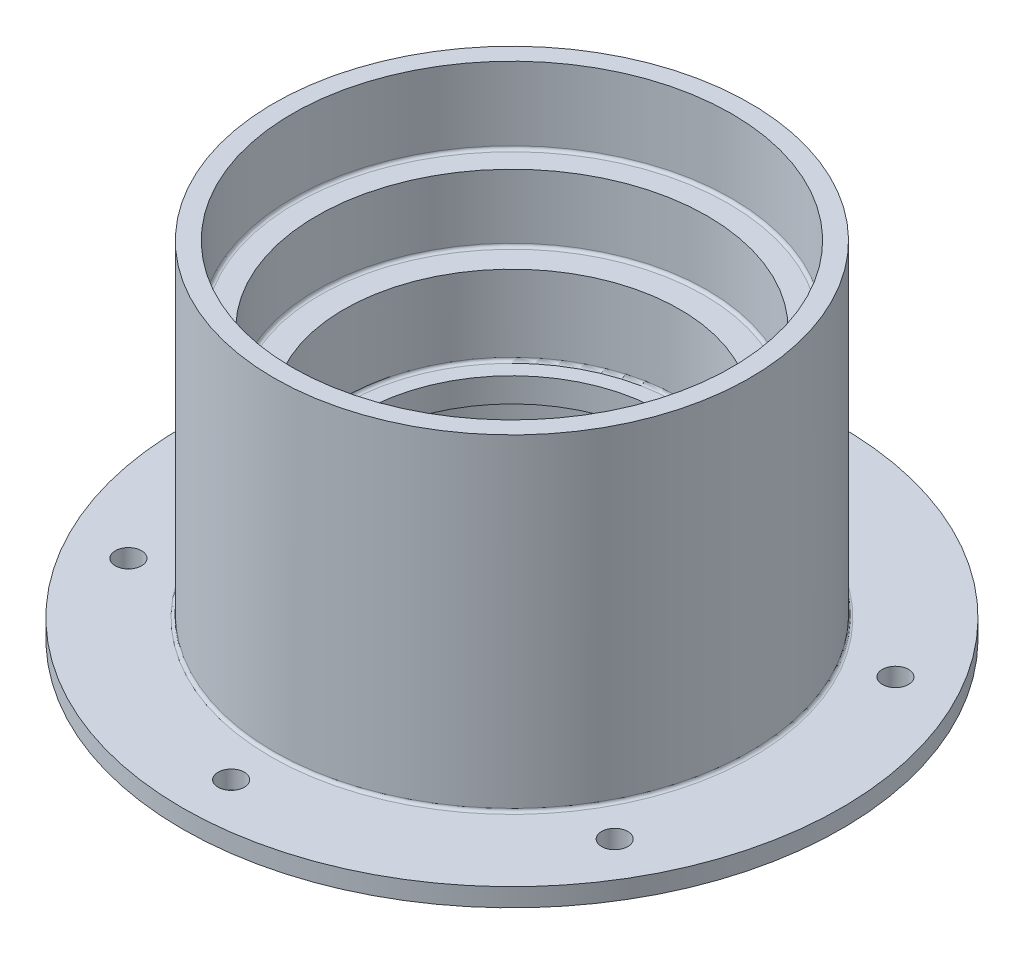
ISO-10303-21;
HEADER;
FILE_DESCRIPTION(('STEP AP214'),'2;1');
FILE_NAME('part.step','',(''),(''),'','','');
FILE_SCHEMA(('AUTOMOTIVE_DESIGN { 1 0 10303 214 1 1 1 1 }'));
ENDSEC;
DATA;
#1=APPLICATION_CONTEXT('core data for automotive mechanical design processes');
#2=APPLICATION_PROTOCOL_DEFINITION('international standard','automotive_design',2000,#1);
#3=PRODUCT_CONTEXT('',#1,'mechanical');
#4=PRODUCT('Part','Part','',(#3));
#5=PRODUCT_RELATED_PRODUCT_CATEGORY('part','',(#4));
#6=PRODUCT_DEFINITION_FORMATION('','',#4);
#7=PRODUCT_DEFINITION_CONTEXT('part definition',#1,'design');
#8=PRODUCT_DEFINITION('design','',#6,#7);
#9=PRODUCT_DEFINITION_SHAPE('','',#8);
#10=(LENGTH_UNIT() NAMED_UNIT(*) SI_UNIT(.MILLI.,.METRE.));
#11=(NAMED_UNIT(*) PLANE_ANGLE_UNIT() SI_UNIT($,.RADIAN.));
#12=(NAMED_UNIT(*) SI_UNIT($,.STERADIAN.) SOLID_ANGLE_UNIT());
#13=UNCERTAINTY_MEASURE_WITH_UNIT(LENGTH_MEASURE(1.E-05),#10,'distance_accuracy_value','');
#14=(GEOMETRIC_REPRESENTATION_CONTEXT(3) GLOBAL_UNCERTAINTY_ASSIGNED_CONTEXT((#13)) GLOBAL_UNIT_ASSIGNED_CONTEXT((#10,
#11,#12)) REPRESENTATION_CONTEXT('',''));
#15=CARTESIAN_POINT('',(0.,0.,0.));
#16=DIRECTION('',(0.,0.,1.));
#17=DIRECTION('',(1.,0.,0.));
#18=AXIS2_PLACEMENT_3D('',#15,#16,#17);
#19=CARTESIAN_POINT('',(0.,-3.,0.));
#20=DIRECTION('',(0.,1.,0.));
#21=DIRECTION('',(0.,0.,1.));
#22=AXIS2_PLACEMENT_3D('',#19,#20,#21);
#23=PLANE('',#22);
#24=CARTESIAN_POINT('',(0.,-3.,0.));
#25=DIRECTION('',(0.,1.,0.));
#26=DIRECTION('',(0.,0.,1.));
#27=AXIS2_PLACEMENT_3D('',#24,#25,#26);
#28=CIRCLE('',#27,39.);
#29=CARTESIAN_POINT('',(0.,-3.,39.));
#30=VERTEX_POINT('',#29);
#31=EDGE_CURVE('E166',#30,#30,#28,.T.);
#32=ORIENTED_EDGE('',*,*,#31,.T.);
#33=EDGE_LOOP('',(#32));
#34=FACE_BOUND('',#33,.T.);
#35=CARTESIAN_POINT('',(0.,-3.,0.));
#36=DIRECTION('',(0.,1.,0.));
#37=DIRECTION('',(0.,0.,1.));
#38=AXIS2_PLACEMENT_3D('',#35,#36,#37);
#39=CIRCLE('',#38,36.);
#40=CARTESIAN_POINT('',(0.,-3.,36.));
#41=VERTEX_POINT('',#40);
#42=EDGE_CURVE('E142',#41,#41,#39,.T.);
#43=ORIENTED_EDGE('',*,*,#42,.F.);
#44=EDGE_LOOP('',(#43));
#45=FACE_BOUND('',#44,.T.);
#46=ADVANCED_FACE('F38',(#34,#45),#23,.T.);
#47=CARTESIAN_POINT('',(0.,0.,0.));
#48=DIRECTION('',(0.,1.,0.));
#49=DIRECTION('',(0.,0.,1.));
#50=AXIS2_PLACEMENT_3D('',#47,#48,#49);
#51=CYLINDRICAL_SURFACE('',#50,39.);
#52=DIRECTION('',(0.,-1.,0.));
#53=VECTOR('',#52,1.);
#54=CARTESIAN_POINT('',(-37.4165738677394,-46.5,11.));
#55=LINE('',#54,#53);
#56=CARTESIAN_POINT('',(-37.4165738677394,-46.5,11.));
#57=VERTEX_POINT('',#56);
#58=CARTESIAN_POINT('',(-37.4165738677394,-56.,11.));
#59=VERTEX_POINT('',#58);
#60=EDGE_CURVE('E107',#57,#59,#55,.T.);
#61=ORIENTED_EDGE('',*,*,#60,.T.);
#62=CARTESIAN_POINT('',(0.,-56.,0.));
#63=DIRECTION('',(0.,-1.,0.));
#64=DIRECTION('',(0.,0.,-1.));
#65=AXIS2_PLACEMENT_3D('',#62,#63,#64);
#66=CIRCLE('',#65,39.);
#67=CARTESIAN_POINT('',(-37.4165738677394,-56.,-11.));
#68=VERTEX_POINT('',#67);
#69=EDGE_CURVE('E113',#59,#68,#66,.F.);
#70=ORIENTED_EDGE('',*,*,#69,.T.);
#71=DIRECTION('',(0.,-1.,0.));
#72=VECTOR('',#71,1.);
#73=CARTESIAN_POINT('',(-37.4165738677394,-46.5,-11.));
#74=LINE('',#73,#72);
#75=CARTESIAN_POINT('',(-37.4165738677394,-46.5,-11.));
#76=VERTEX_POINT('',#75);
#77=EDGE_CURVE('E93',#76,#68,#74,.T.);
#78=ORIENTED_EDGE('',*,*,#77,.F.);
#79=CARTESIAN_POINT('',(0.,-46.5,0.));
#80=DIRECTION('',(0.,1.,0.));
#81=DIRECTION('',(0.,0.,1.));
#82=AXIS2_PLACEMENT_3D('',#79,#80,#81);
#83=CIRCLE('',#82,39.);
#84=EDGE_CURVE('E98',#57,#76,#83,.F.);
#85=ORIENTED_EDGE('',*,*,#84,.F.);
#86=EDGE_LOOP('',(#61,#70,#78,#85));
#87=FACE_BOUND('',#86,.T.);
#88=ORIENTED_EDGE('',*,*,#31,.F.);
#89=EDGE_LOOP('',(#88));
#90=FACE_BOUND('',#89,.T.);
#91=ADVANCED_FACE('F110',(#87,#90),#51,.T.);
#92=CARTESIAN_POINT('',(0.,-56.5,0.));
#93=DIRECTION('',(0.,-1.,0.));
#94=DIRECTION('',(0.,0.,-1.));
#95=AXIS2_PLACEMENT_3D('',#92,#93,#94);
#96=PLANE('',#95);
#97=CARTESIAN_POINT('',(0.,-56.5,-46.));
#98=DIRECTION('',(0.,1.,0.));
#99=DIRECTION('',(0.,0.,1.));
#100=AXIS2_PLACEMENT_3D('',#97,#98,#99);
#101=CIRCLE('',#100,2.14999999999999);
#102=CARTESIAN_POINT('',(0.,-56.5,-43.85));
#103=VERTEX_POINT('',#102);
#104=EDGE_CURVE('E114',#103,#103,#101,.T.);
#105=ORIENTED_EDGE('',*,*,#104,.F.);
#106=EDGE_LOOP('',(#105));
#107=FACE_BOUND('',#106,.T.);
#108=CARTESIAN_POINT('',(39.837168574085,-56.5,-23.0000000000014));
#109=DIRECTION('',(0.,1.,0.));
#110=DIRECTION('',(0.,0.,1.));
#111=AXIS2_PLACEMENT_3D('',#108,#109,#110);
#112=CIRCLE('',#111,2.14999999999999);
#113=CARTESIAN_POINT('',(39.837168574085,-56.5,-20.8500000000014));
#114=VERTEX_POINT('',#113);
#115=EDGE_CURVE('E122',#114,#114,#112,.T.);
#116=ORIENTED_EDGE('',*,*,#115,.F.);
#117=EDGE_LOOP('',(#116));
#118=FACE_BOUND('',#117,.T.);
#119=CARTESIAN_POINT('',(39.8371685740866,-56.5,22.9999999999986));
#120=DIRECTION('',(0.,1.,0.));
#121=DIRECTION('',(0.,0.,1.));
#122=AXIS2_PLACEMENT_3D('',#119,#120,#121);
#123=CIRCLE('',#122,2.14999999999999);
#124=CARTESIAN_POINT('',(39.8371685740866,-56.5,25.1499999999986));
#125=VERTEX_POINT('',#124);
#126=EDGE_CURVE('E126',#125,#125,#123,.T.);
#127=ORIENTED_EDGE('',*,*,#126,.F.);
#128=EDGE_LOOP('',(#127));
#129=FACE_BOUND('',#128,.T.);
#130=CARTESIAN_POINT('',(3.27419614395759E-12,-56.5,46.));
#131=DIRECTION('',(0.,1.,0.));
#132=DIRECTION('',(0.,0.,1.));
#133=AXIS2_PLACEMENT_3D('',#130,#131,#132);
#134=CIRCLE('',#133,2.14999999999999);
#135=CARTESIAN_POINT('',(3.27419614395759E-12,-56.5,48.15));
#136=VERTEX_POINT('',#135);
#137=EDGE_CURVE('E130',#136,#136,#134,.T.);
#138=ORIENTED_EDGE('',*,*,#137,.F.);
#139=EDGE_LOOP('',(#138));
#140=FACE_BOUND('',#139,.T.);
#141=CARTESIAN_POINT('',(-39.8371685740817,-56.5,23.0000000000014));
#142=DIRECTION('',(0.,1.,0.));
#143=DIRECTION('',(0.,0.,1.));
#144=AXIS2_PLACEMENT_3D('',#141,#142,#143);
#145=CIRCLE('',#144,2.14999999999999);
#146=CARTESIAN_POINT('',(-39.8371685740817,-56.5,25.1500000000014));
#147=VERTEX_POINT('',#146);
#148=EDGE_CURVE('E134',#147,#147,#145,.T.);
#149=ORIENTED_EDGE('',*,*,#148,.F.);
#150=EDGE_LOOP('',(#149));
#151=FACE_BOUND('',#150,.T.);
#152=CARTESIAN_POINT('',(-39.8371685740834,-56.5,-22.9999999999986));
#153=DIRECTION('',(0.,1.,0.));
#154=DIRECTION('',(0.,0.,1.));
#155=AXIS2_PLACEMENT_3D('',#152,#153,#154);
#156=CIRCLE('',#155,2.14999999999999);
#157=CARTESIAN_POINT('',(-39.8371685740834,-56.5,-20.8499999999986));
#158=VERTEX_POINT('',#157);
#159=EDGE_CURVE('E138',#158,#158,#156,.T.);
#160=ORIENTED_EDGE('',*,*,#159,.F.);
#161=EDGE_LOOP('',(#160));
#162=FACE_BOUND('',#161,.T.);
#163=DIRECTION('',(-1.,0.,0.));
#164=VECTOR('',#163,1.);
#165=CARTESIAN_POINT('',(0.,-56.5,-11.));
#166=LINE('',#165,#164);
#167=CARTESIAN_POINT('',(-30.0499584026334,-56.5,-11.));
#168=VERTEX_POINT('',#167);
#169=CARTESIAN_POINT('',(-37.9374485172632,-56.5,-11.));
#170=VERTEX_POINT('',#169);
#171=EDGE_CURVE('E58',#168,#170,#166,.T.);
#172=ORIENTED_EDGE('',*,*,#171,.T.);
#173=CARTESIAN_POINT('',(0.,-56.5,0.));
#174=DIRECTION('',(0.,-1.,0.));
#175=DIRECTION('',(0.,0.,-1.));
#176=AXIS2_PLACEMENT_3D('',#173,#174,#175);
#177=CIRCLE('',#176,39.5);
#178=CARTESIAN_POINT('',(-37.9374485172632,-56.5,11.));
#179=VERTEX_POINT('',#178);
#180=EDGE_CURVE('E202',#170,#179,#177,.T.);
#181=ORIENTED_EDGE('',*,*,#180,.T.);
#182=DIRECTION('',(-1.,0.,0.));
#183=VECTOR('',#182,1.);
#184=CARTESIAN_POINT('',(0.,-56.5,11.));
#185=LINE('',#184,#183);
#186=CARTESIAN_POINT('',(-30.0499584026334,-56.5,11.));
#187=VERTEX_POINT('',#186);
#188=EDGE_CURVE('E65',#187,#179,#185,.T.);
#189=ORIENTED_EDGE('',*,*,#188,.F.);
#190=CARTESIAN_POINT('',(0.,-56.5,0.));
#191=DIRECTION('',(0.,1.,0.));
#192=DIRECTION('',(0.,0.,1.));
#193=AXIS2_PLACEMENT_3D('',#190,#191,#192);
#194=CIRCLE('',#193,32.);
#195=EDGE_CURVE('E169',#187,#168,#194,.F.);
#196=ORIENTED_EDGE('',*,*,#195,.T.);
#197=EDGE_LOOP('',(#172,#181,#189,#196));
#198=FACE_BOUND('',#197,.T.);
#199=CARTESIAN_POINT('',(0.,-56.5,0.));
#200=DIRECTION('',(0.,1.,0.));
#201=DIRECTION('',(0.,0.,1.));
#202=AXIS2_PLACEMENT_3D('',#199,#200,#201);
#203=CIRCLE('',#202,54.);
#204=CARTESIAN_POINT('',(0.,-56.5,54.));
#205=VERTEX_POINT('',#204);
#206=EDGE_CURVE('E163',#205,#205,#203,.T.);
#207=ORIENTED_EDGE('',*,*,#206,.T.);
#208=EDGE_LOOP('',(#207));
#209=FACE_BOUND('',#208,.T.);
#210=ADVANCED_FACE('F296',(#107,#118,#129,#140,#151,#162,#198,#209),#96,.F.);
#211=CARTESIAN_POINT('',(0.,0.,0.));
#212=DIRECTION('',(0.,1.,0.));
#213=DIRECTION('',(0.,0.,1.));
#214=AXIS2_PLACEMENT_3D('',#211,#212,#213);
#215=CYLINDRICAL_SURFACE('',#214,54.);
#216=ORIENTED_EDGE('',*,*,#206,.F.);
#217=EDGE_LOOP('',(#216));
#218=FACE_BOUND('',#217,.T.);
#219=CARTESIAN_POINT('',(0.,-59.5,0.));
#220=DIRECTION('',(0.,1.,0.));
#221=DIRECTION('',(0.,0.,1.));
#222=AXIS2_PLACEMENT_3D('',#219,#220,#221);
#223=CIRCLE('',#222,54.);
#224=CARTESIAN_POINT('',(0.,-59.5,54.));
#225=VERTEX_POINT('',#224);
#226=EDGE_CURVE('E160',#225,#225,#223,.T.);
#227=ORIENTED_EDGE('',*,*,#226,.T.);
#228=EDGE_LOOP('',(#227));
#229=FACE_BOUND('',#228,.T.);
#230=ADVANCED_FACE('F292',(#218,#229),#215,.T.);
#231=CARTESIAN_POINT('',(0.,-59.5,0.));
#232=DIRECTION('',(0.,1.,0.));
#233=DIRECTION('',(0.,0.,1.));
#234=AXIS2_PLACEMENT_3D('',#231,#232,#233);
#235=PLANE('',#234);
#236=CARTESIAN_POINT('',(0.,-59.5,-46.));
#237=DIRECTION('',(0.,1.,0.));
#238=DIRECTION('',(0.,0.,1.));
#239=AXIS2_PLACEMENT_3D('',#236,#237,#238);
#240=CIRCLE('',#239,2.14999999999998);
#241=CARTESIAN_POINT('',(0.,-59.5,-43.85));
#242=VERTEX_POINT('',#241);
#243=EDGE_CURVE('E117',#242,#242,#240,.T.);
#244=ORIENTED_EDGE('',*,*,#243,.T.);
#245=EDGE_LOOP('',(#244));
#246=FACE_BOUND('',#245,.T.);
#247=CARTESIAN_POINT('',(39.837168574085,-59.5,-23.0000000000014));
#248=DIRECTION('',(0.,1.,0.));
#249=DIRECTION('',(0.,0.,1.));
#250=AXIS2_PLACEMENT_3D('',#247,#248,#249);
#251=CIRCLE('',#250,2.14999999999998);
#252=CARTESIAN_POINT('',(39.837168574085,-59.5,-20.8500000000014));
#253=VERTEX_POINT('',#252);
#254=EDGE_CURVE('E125',#253,#253,#251,.T.);
#255=ORIENTED_EDGE('',*,*,#254,.T.);
#256=EDGE_LOOP('',(#255));
#257=FACE_BOUND('',#256,.T.);
#258=CARTESIAN_POINT('',(39.8371685740866,-59.5,22.9999999999986));
#259=DIRECTION('',(0.,1.,0.));
#260=DIRECTION('',(0.,0.,1.));
#261=AXIS2_PLACEMENT_3D('',#258,#259,#260);
#262=CIRCLE('',#261,2.14999999999998);
#263=CARTESIAN_POINT('',(39.8371685740866,-59.5,25.1499999999986));
#264=VERTEX_POINT('',#263);
#265=EDGE_CURVE('E129',#264,#264,#262,.T.);
#266=ORIENTED_EDGE('',*,*,#265,.T.);
#267=EDGE_LOOP('',(#266));
#268=FACE_BOUND('',#267,.T.);
#269=CARTESIAN_POINT('',(3.27419614395759E-12,-59.5,46.));
#270=DIRECTION('',(0.,1.,0.));
#271=DIRECTION('',(0.,0.,1.));
#272=AXIS2_PLACEMENT_3D('',#269,#270,#271);
#273=CIRCLE('',#272,2.14999999999998);
#274=CARTESIAN_POINT('',(3.27419614395759E-12,-59.5,48.15));
#275=VERTEX_POINT('',#274);
#276=EDGE_CURVE('E133',#275,#275,#273,.T.);
#277=ORIENTED_EDGE('',*,*,#276,.T.);
#278=EDGE_LOOP('',(#277));
#279=FACE_BOUND('',#278,.T.);
#280=CARTESIAN_POINT('',(-39.8371685740817,-59.5,23.0000000000014));
#281=DIRECTION('',(0.,1.,0.));
#282=DIRECTION('',(0.,0.,1.));
#283=AXIS2_PLACEMENT_3D('',#280,#281,#282);
#284=CIRCLE('',#283,2.14999999999998);
#285=CARTESIAN_POINT('',(-39.8371685740817,-59.5,25.1500000000014));
#286=VERTEX_POINT('',#285);
#287=EDGE_CURVE('E137',#286,#286,#284,.T.);
#288=ORIENTED_EDGE('',*,*,#287,.T.);
#289=EDGE_LOOP('',(#288));
#290=FACE_BOUND('',#289,.T.);
#291=CARTESIAN_POINT('',(-39.8371685740834,-59.5,-22.9999999999986));
#292=DIRECTION('',(0.,1.,0.));
#293=DIRECTION('',(0.,0.,1.));
#294=AXIS2_PLACEMENT_3D('',#291,#292,#293);
#295=CIRCLE('',#294,2.14999999999998);
#296=CARTESIAN_POINT('',(-39.8371685740834,-59.5,-20.8499999999986));
#297=VERTEX_POINT('',#296);
#298=EDGE_CURVE('E141',#297,#297,#295,.T.);
#299=ORIENTED_EDGE('',*,*,#298,.T.);
#300=EDGE_LOOP('',(#299));
#301=FACE_BOUND('',#300,.T.);
#302=ORIENTED_EDGE('',*,*,#226,.F.);
#303=EDGE_LOOP('',(#302));
#304=FACE_BOUND('',#303,.T.);
#305=CARTESIAN_POINT('',(0.,-59.5,0.));
#306=DIRECTION('',(0.,1.,0.));
#307=DIRECTION('',(0.,0.,1.));
#308=AXIS2_PLACEMENT_3D('',#305,#306,#307);
#309=CIRCLE('',#308,32.);
#310=CARTESIAN_POINT('',(0.,-59.5,32.));
#311=VERTEX_POINT('',#310);
#312=EDGE_CURVE('E157',#311,#311,#309,.T.);
#313=ORIENTED_EDGE('',*,*,#312,.T.);
#314=EDGE_LOOP('',(#313));
#315=FACE_BOUND('',#314,.T.);
#316=ADVANCED_FACE('F288',(#246,#257,#268,#279,#290,#301,#304,#315),#235,.F.);
#317=CARTESIAN_POINT('',(0.,0.,0.));
#318=DIRECTION('',(0.,1.,0.));
#319=DIRECTION('',(0.,0.,1.));
#320=AXIS2_PLACEMENT_3D('',#317,#318,#319);
#321=CYLINDRICAL_SURFACE('',#320,32.);
#322=CARTESIAN_POINT('',(0.,-44.,0.));
#323=DIRECTION('',(0.,1.,0.));
#324=DIRECTION('',(0.,0.,1.));
#325=AXIS2_PLACEMENT_3D('',#322,#323,#324);
#326=CIRCLE('',#325,32.);
#327=CARTESIAN_POINT('',(0.,-44.,32.));
#328=VERTEX_POINT('',#327);
#329=EDGE_CURVE('E189',#328,#328,#326,.T.);
#330=ORIENTED_EDGE('',*,*,#329,.T.);
#331=EDGE_LOOP('',(#330));
#332=FACE_BOUND('',#331,.T.);
#333=DIRECTION('',(0.,1.,0.));
#334=VECTOR('',#333,1.);
#335=CARTESIAN_POINT('',(-30.0499584026334,0.,11.));
#336=LINE('',#335,#334);
#337=CARTESIAN_POINT('',(-30.0499584026334,-46.5,11.));
#338=VERTEX_POINT('',#337);
#339=EDGE_CURVE('E184',#187,#338,#336,.T.);
#340=ORIENTED_EDGE('',*,*,#339,.T.);
#341=CARTESIAN_POINT('',(0.,-46.5,0.));
#342=DIRECTION('',(0.,1.,0.));
#343=DIRECTION('',(0.,0.,1.));
#344=AXIS2_PLACEMENT_3D('',#341,#342,#343);
#345=CIRCLE('',#344,32.);
#346=CARTESIAN_POINT('',(-30.0499584026334,-46.5,-11.));
#347=VERTEX_POINT('',#346);
#348=EDGE_CURVE('E187',#338,#347,#345,.F.);
#349=ORIENTED_EDGE('',*,*,#348,.T.);
#350=DIRECTION('',(0.,1.,0.));
#351=VECTOR('',#350,1.);
#352=CARTESIAN_POINT('',(-30.0499584026334,0.,-11.));
#353=LINE('',#352,#351);
#354=EDGE_CURVE('E95',#168,#347,#353,.T.);
#355=ORIENTED_EDGE('',*,*,#354,.F.);
#356=ORIENTED_EDGE('',*,*,#195,.F.);
#357=EDGE_LOOP('',(#340,#349,#355,#356));
#358=FACE_BOUND('',#357,.T.);
#359=ORIENTED_EDGE('',*,*,#312,.F.);
#360=EDGE_LOOP('',(#359));
#361=FACE_BOUND('',#360,.T.);
#362=ADVANCED_FACE('F284',(#332,#358,#361),#321,.F.);
#363=CARTESIAN_POINT('',(0.,-43.5,0.));
#364=DIRECTION('',(0.,1.,0.));
#365=DIRECTION('',(0.,0.,1.));
#366=AXIS2_PLACEMENT_3D('',#363,#364,#365);
#367=PLANE('',#366);
#368=CARTESIAN_POINT('',(0.,-43.5,0.));
#369=DIRECTION('',(0.,1.,0.));
#370=DIRECTION('',(0.,0.,1.));
#371=AXIS2_PLACEMENT_3D('',#368,#369,#370);
#372=CIRCLE('',#371,31.5);
#373=CARTESIAN_POINT('',(0.,-43.5,31.5));
#374=VERTEX_POINT('',#373);
#375=EDGE_CURVE('E192',#374,#374,#372,.F.);
#376=ORIENTED_EDGE('',*,*,#375,.T.);
#377=EDGE_LOOP('',(#376));
#378=FACE_BOUND('',#377,.T.);
#379=CARTESIAN_POINT('',(0.,-43.5,0.));
#380=DIRECTION('',(0.,1.,0.));
#381=DIRECTION('',(0.,0.,1.));
#382=AXIS2_PLACEMENT_3D('',#379,#380,#381);
#383=CIRCLE('',#382,24.5);
#384=CARTESIAN_POINT('',(0.,-43.5,24.5));
#385=VERTEX_POINT('',#384);
#386=EDGE_CURVE('E154',#385,#385,#383,.T.);
#387=ORIENTED_EDGE('',*,*,#386,.T.);
#388=EDGE_LOOP('',(#387));
#389=FACE_BOUND('',#388,.T.);
#390=ADVANCED_FACE('F280',(#378,#389),#367,.F.);
#391=CARTESIAN_POINT('',(0.,0.,0.));
#392=DIRECTION('',(0.,1.,0.));
#393=DIRECTION('',(0.,0.,1.));
#394=AXIS2_PLACEMENT_3D('',#391,#392,#393);
#395=CYLINDRICAL_SURFACE('',#394,24.5);
#396=ORIENTED_EDGE('',*,*,#386,.F.);
#397=EDGE_LOOP('',(#396));
#398=FACE_BOUND('',#397,.T.);
#399=CARTESIAN_POINT('',(0.,-39.5,0.));
#400=DIRECTION('',(0.,1.,0.));
#401=DIRECTION('',(0.,0.,1.));
#402=AXIS2_PLACEMENT_3D('',#399,#400,#401);
#403=CIRCLE('',#402,24.5);
#404=CARTESIAN_POINT('',(0.,-39.5,24.5));
#405=VERTEX_POINT('',#404);
#406=EDGE_CURVE('E151',#405,#405,#403,.T.);
#407=ORIENTED_EDGE('',*,*,#406,.T.);
#408=EDGE_LOOP('',(#407));
#409=FACE_BOUND('',#408,.T.);
#410=ADVANCED_FACE('F276',(#398,#409),#395,.F.);
#411=CARTESIAN_POINT('',(0.,-39.5,0.));
#412=DIRECTION('',(0.,-1.,0.));
#413=DIRECTION('',(0.,0.,-1.));
#414=AXIS2_PLACEMENT_3D('',#411,#412,#413);
#415=PLANE('',#414);
#416=CARTESIAN_POINT('',(0.,-39.5,0.));
#417=DIRECTION('',(0.,-1.,0.));
#418=DIRECTION('',(0.,0.,-1.));
#419=AXIS2_PLACEMENT_3D('',#416,#417,#418);
#420=CIRCLE('',#419,27.);
#421=CARTESIAN_POINT('',(0.,-39.5,-27.));
#422=VERTEX_POINT('',#421);
#423=EDGE_CURVE('E204',#422,#422,#420,.F.);
#424=ORIENTED_EDGE('',*,*,#423,.T.);
#425=EDGE_LOOP('',(#424));
#426=FACE_BOUND('',#425,.T.);
#427=ORIENTED_EDGE('',*,*,#406,.F.);
#428=EDGE_LOOP('',(#427));
#429=FACE_BOUND('',#428,.T.);
#430=ADVANCED_FACE('F272',(#426,#429),#415,.F.);
#431=CARTESIAN_POINT('',(0.,0.,0.));
#432=DIRECTION('',(0.,1.,0.));
#433=DIRECTION('',(0.,0.,1.));
#434=AXIS2_PLACEMENT_3D('',#431,#432,#433);
#435=CYLINDRICAL_SURFACE('',#434,27.5);
#436=CARTESIAN_POINT('',(0.,-39.,0.));
#437=DIRECTION('',(0.,-1.,0.));
#438=DIRECTION('',(0.,0.,-1.));
#439=AXIS2_PLACEMENT_3D('',#436,#437,#438);
#440=CIRCLE('',#439,27.5);
#441=CARTESIAN_POINT('',(0.,-39.,-27.5));
#442=VERTEX_POINT('',#441);
#443=EDGE_CURVE('E207',#442,#442,#440,.T.);
#444=ORIENTED_EDGE('',*,*,#443,.T.);
#445=EDGE_LOOP('',(#444));
#446=FACE_BOUND('',#445,.T.);
#447=CARTESIAN_POINT('',(0.,-26.5,0.));
#448=DIRECTION('',(0.,1.,0.));
#449=DIRECTION('',(0.,0.,1.));
#450=AXIS2_PLACEMENT_3D('',#447,#448,#449);
#451=CIRCLE('',#450,27.5);
#452=CARTESIAN_POINT('',(0.,-26.5,27.5));
#453=VERTEX_POINT('',#452);
#454=EDGE_CURVE('E148',#453,#453,#451,.T.);
#455=ORIENTED_EDGE('',*,*,#454,.T.);
#456=EDGE_LOOP('',(#455));
#457=FACE_BOUND('',#456,.T.);
#458=ADVANCED_FACE('F268',(#446,#457),#435,.F.);
#459=CARTESIAN_POINT('',(0.,-26.5,0.));
#460=DIRECTION('',(0.,-1.,0.));
#461=DIRECTION('',(0.,0.,-1.));
#462=AXIS2_PLACEMENT_3D('',#459,#460,#461);
#463=PLANE('',#462);
#464=CARTESIAN_POINT('',(0.,-26.5,0.));
#465=DIRECTION('',(0.,-1.,0.));
#466=DIRECTION('',(0.,0.,-1.));
#467=AXIS2_PLACEMENT_3D('',#464,#465,#466);
#468=CIRCLE('',#467,31.5);
#469=CARTESIAN_POINT('',(0.,-26.5,-31.5));
#470=VERTEX_POINT('',#469);
#471=EDGE_CURVE('E195',#470,#470,#468,.F.);
#472=ORIENTED_EDGE('',*,*,#471,.T.);
#473=EDGE_LOOP('',(#472));
#474=FACE_BOUND('',#473,.T.);
#475=ORIENTED_EDGE('',*,*,#454,.F.);
#476=EDGE_LOOP('',(#475));
#477=FACE_BOUND('',#476,.T.);
#478=ADVANCED_FACE('F264',(#474,#477),#463,.F.);
#479=CARTESIAN_POINT('',(0.,0.,0.));
#480=DIRECTION('',(0.,1.,0.));
#481=DIRECTION('',(0.,0.,1.));
#482=AXIS2_PLACEMENT_3D('',#479,#480,#481);
#483=CYLINDRICAL_SURFACE('',#482,32.);
#484=CARTESIAN_POINT('',(0.,-26.,0.));
#485=DIRECTION('',(0.,-1.,0.));
#486=DIRECTION('',(0.,0.,-1.));
#487=AXIS2_PLACEMENT_3D('',#484,#485,#486);
#488=CIRCLE('',#487,32.);
#489=CARTESIAN_POINT('',(0.,-26.,-32.));
#490=VERTEX_POINT('',#489);
#491=EDGE_CURVE('E198',#490,#490,#488,.T.);
#492=ORIENTED_EDGE('',*,*,#491,.T.);
#493=EDGE_LOOP('',(#492));
#494=FACE_BOUND('',#493,.T.);
#495=CARTESIAN_POINT('',(0.,-15.5,0.));
#496=DIRECTION('',(0.,1.,0.));
#497=DIRECTION('',(0.,0.,1.));
#498=AXIS2_PLACEMENT_3D('',#495,#496,#497);
#499=CIRCLE('',#498,32.);
#500=CARTESIAN_POINT('',(0.,-15.5,32.));
#501=VERTEX_POINT('',#500);
#502=EDGE_CURVE('E145',#501,#501,#499,.T.);
#503=ORIENTED_EDGE('',*,*,#502,.T.);
#504=EDGE_LOOP('',(#503));
#505=FACE_BOUND('',#504,.T.);
#506=ADVANCED_FACE('F260',(#494,#505),#483,.F.);
#507=CARTESIAN_POINT('',(0.,-15.5,0.));
#508=DIRECTION('',(0.,-1.,0.));
#509=DIRECTION('',(0.,0.,-1.));
#510=AXIS2_PLACEMENT_3D('',#507,#508,#509);
#511=PLANE('',#510);
#512=CARTESIAN_POINT('',(0.,-15.5,0.));
#513=DIRECTION('',(0.,-1.,0.));
#514=DIRECTION('',(0.,0.,-1.));
#515=AXIS2_PLACEMENT_3D('',#512,#513,#514);
#516=CIRCLE('',#515,35.5);
#517=CARTESIAN_POINT('',(0.,-15.5,-35.5));
#518=VERTEX_POINT('',#517);
#519=EDGE_CURVE('E210',#518,#518,#516,.F.);
#520=ORIENTED_EDGE('',*,*,#519,.T.);
#521=EDGE_LOOP('',(#520));
#522=FACE_BOUND('',#521,.T.);
#523=ORIENTED_EDGE('',*,*,#502,.F.);
#524=EDGE_LOOP('',(#523));
#525=FACE_BOUND('',#524,.T.);
#526=ADVANCED_FACE('F256',(#522,#525),#511,.F.);
#527=CARTESIAN_POINT('',(0.,0.,0.));
#528=DIRECTION('',(0.,1.,0.));
#529=DIRECTION('',(0.,0.,1.));
#530=AXIS2_PLACEMENT_3D('',#527,#528,#529);
#531=CYLINDRICAL_SURFACE('',#530,36.);
#532=CARTESIAN_POINT('',(0.,-15.,0.));
#533=DIRECTION('',(0.,-1.,0.));
#534=DIRECTION('',(0.,0.,-1.));
#535=AXIS2_PLACEMENT_3D('',#532,#533,#534);
#536=CIRCLE('',#535,36.);
#537=CARTESIAN_POINT('',(0.,-15.,-36.));
#538=VERTEX_POINT('',#537);
#539=EDGE_CURVE('E213',#538,#538,#536,.T.);
#540=ORIENTED_EDGE('',*,*,#539,.T.);
#541=EDGE_LOOP('',(#540));
#542=FACE_BOUND('',#541,.T.);
#543=ORIENTED_EDGE('',*,*,#42,.T.);
#544=EDGE_LOOP('',(#543));
#545=FACE_BOUND('',#544,.T.);
#546=ADVANCED_FACE('F252',(#542,#545),#531,.F.);
#547=CARTESIAN_POINT('',(-39.8371685740834,-56.5,-22.9999999999986));
#548=DIRECTION('',(0.,1.,0.));
#549=DIRECTION('',(0.,0.,1.));
#550=AXIS2_PLACEMENT_3D('',#547,#548,#549);
#551=CYLINDRICAL_SURFACE('',#550,2.14999999999998);
#552=ORIENTED_EDGE('',*,*,#159,.T.);
#553=EDGE_LOOP('',(#552));
#554=FACE_BOUND('',#553,.T.);
#555=ORIENTED_EDGE('',*,*,#298,.F.);
#556=EDGE_LOOP('',(#555));
#557=FACE_BOUND('',#556,.T.);
#558=ADVANCED_FACE('F248',(#554,#557),#551,.F.);
#559=CARTESIAN_POINT('',(-39.8371685740817,-56.5,23.0000000000014));
#560=DIRECTION('',(0.,1.,0.));
#561=DIRECTION('',(0.,0.,1.));
#562=AXIS2_PLACEMENT_3D('',#559,#560,#561);
#563=CYLINDRICAL_SURFACE('',#562,2.14999999999998);
#564=ORIENTED_EDGE('',*,*,#148,.T.);
#565=EDGE_LOOP('',(#564));
#566=FACE_BOUND('',#565,.T.);
#567=ORIENTED_EDGE('',*,*,#287,.F.);
#568=EDGE_LOOP('',(#567));
#569=FACE_BOUND('',#568,.T.);
#570=ADVANCED_FACE('F244',(#566,#569),#563,.F.);
#571=CARTESIAN_POINT('',(3.27419614395759E-12,-56.5,46.));
#572=DIRECTION('',(0.,1.,0.));
#573=DIRECTION('',(0.,0.,1.));
#574=AXIS2_PLACEMENT_3D('',#571,#572,#573);
#575=CYLINDRICAL_SURFACE('',#574,2.14999999999998);
#576=ORIENTED_EDGE('',*,*,#137,.T.);
#577=EDGE_LOOP('',(#576));
#578=FACE_BOUND('',#577,.T.);
#579=ORIENTED_EDGE('',*,*,#276,.F.);
#580=EDGE_LOOP('',(#579));
#581=FACE_BOUND('',#580,.T.);
#582=ADVANCED_FACE('F240',(#578,#581),#575,.F.);
#583=CARTESIAN_POINT('',(39.8371685740866,-56.5,22.9999999999986));
#584=DIRECTION('',(0.,1.,0.));
#585=DIRECTION('',(0.,0.,1.));
#586=AXIS2_PLACEMENT_3D('',#583,#584,#585);
#587=CYLINDRICAL_SURFACE('',#586,2.14999999999998);
#588=ORIENTED_EDGE('',*,*,#126,.T.);
#589=EDGE_LOOP('',(#588));
#590=FACE_BOUND('',#589,.T.);
#591=ORIENTED_EDGE('',*,*,#265,.F.);
#592=EDGE_LOOP('',(#591));
#593=FACE_BOUND('',#592,.T.);
#594=ADVANCED_FACE('F236',(#590,#593),#587,.F.);
#595=CARTESIAN_POINT('',(39.837168574085,-56.5,-23.0000000000014));
#596=DIRECTION('',(0.,1.,0.));
#597=DIRECTION('',(0.,0.,1.));
#598=AXIS2_PLACEMENT_3D('',#595,#596,#597);
#599=CYLINDRICAL_SURFACE('',#598,2.14999999999998);
#600=ORIENTED_EDGE('',*,*,#115,.T.);
#601=EDGE_LOOP('',(#600));
#602=FACE_BOUND('',#601,.T.);
#603=ORIENTED_EDGE('',*,*,#254,.F.);
#604=EDGE_LOOP('',(#603));
#605=FACE_BOUND('',#604,.T.);
#606=ADVANCED_FACE('F232',(#602,#605),#599,.F.);
#607=CARTESIAN_POINT('',(0.,-56.5,-46.));
#608=DIRECTION('',(0.,1.,0.));
#609=DIRECTION('',(0.,0.,1.));
#610=AXIS2_PLACEMENT_3D('',#607,#608,#609);
#611=CYLINDRICAL_SURFACE('',#610,2.14999999999998);
#612=ORIENTED_EDGE('',*,*,#104,.T.);
#613=EDGE_LOOP('',(#612));
#614=FACE_BOUND('',#613,.T.);
#615=ORIENTED_EDGE('',*,*,#243,.F.);
#616=EDGE_LOOP('',(#615));
#617=FACE_BOUND('',#616,.T.);
#618=ADVANCED_FACE('F229',(#614,#617),#611,.F.);
#619=CARTESIAN_POINT('',(0.,-46.5,11.));
#620=DIRECTION('',(0.,0.,1.));
#621=DIRECTION('',(1.,0.,0.));
#622=AXIS2_PLACEMENT_3D('',#619,#620,#621);
#623=PLANE('',#622);
#624=ORIENTED_EDGE('',*,*,#188,.T.);
#625=CARTESIAN_POINT('',(-37.9374485172632,-56.5,11.));
#626=CARTESIAN_POINT('',(-37.9072381899858,-56.5000195555024,11.));
#627=CARTESIAN_POINT('',(-37.8770283870847,-56.4974752782767,11.));
#628=CARTESIAN_POINT('',(-37.8174391870203,-56.4873980302927,11.));
#629=CARTESIAN_POINT('',(-37.7880601545099,-56.4798629032641,11.));
#630=CARTESIAN_POINT('',(-37.7309647113152,-56.4599345259352,11.));
#631=CARTESIAN_POINT('',(-37.7032497629658,-56.447537072818,11.));
#632=CARTESIAN_POINT('',(-37.6503619729387,-56.4181821613451,11.));
#633=CARTESIAN_POINT('',(-37.6251878431716,-56.401227029677,11.));
#634=CARTESIAN_POINT('',(-37.5786410967669,-56.3635469144082,11.));
#635=CARTESIAN_POINT('',(-37.5572042268605,-56.342901413392,11.));
#636=CARTESIAN_POINT('',(-37.5182684036524,-56.2981669244708,11.));
#637=CARTESIAN_POINT('',(-37.5007697677282,-56.2740776592925,11.));
#638=CARTESIAN_POINT('',(-37.4709529679507,-56.2241595982193,11.));
#639=CARTESIAN_POINT('',(-37.4584589713015,-56.1984356729067,11.));
#640=CARTESIAN_POINT('',(-37.4381654696594,-56.1452125895194,11.));
#641=CARTESIAN_POINT('',(-37.4303603318948,-56.1177156056087,11.));
#642=CARTESIAN_POINT('',(-37.4222262439895,-56.0749721264369,11.));
#643=CARTESIAN_POINT('',(-37.4201076031291,-56.0600456997704,11.));
#644=CARTESIAN_POINT('',(-37.4172821415553,-56.0300820842821,11.));
#645=CARTESIAN_POINT('',(-37.4165732422569,-56.0150450913925,11.));
#646=CARTESIAN_POINT('',(-37.4165738677392,-56.,11.));
#647=B_SPLINE_CURVE_WITH_KNOTS('',3,(#625,#626,#627,#628,#629,#630,#631,#632,#633,#634,#635,
#636,#637,#638,#639,#640,#641,#642,#643,#644,#645,#646),.UNSPECIFIED.,.F.,.F.,(4,2,2,2,2,2,2,2,
2,2,4),(0.,0.0905247121569601,0.181088560568689,0.271730862192782,0.362326978659236,
0.45116622158737,0.540012621402917,0.625384464419605,0.710653543250501,0.755822872988799,
0.800925553553908),.UNSPECIFIED.);
#648=EDGE_CURVE('E11',#179,#59,#647,.T.);
#649=ORIENTED_EDGE('',*,*,#648,.T.);
#650=ORIENTED_EDGE('',*,*,#60,.F.);
#651=DIRECTION('',(-1.,0.,0.));
#652=VECTOR('',#651,1.);
#653=CARTESIAN_POINT('',(0.,-46.5,11.));
#654=LINE('',#653,#652);
#655=EDGE_CURVE('E99',#338,#57,#654,.T.);
#656=ORIENTED_EDGE('',*,*,#655,.F.);
#657=ORIENTED_EDGE('',*,*,#339,.F.);
#658=EDGE_LOOP('',(#624,#649,#650,#656,#657));
#659=FACE_BOUND('',#658,.T.);
#660=ADVANCED_FACE('F225',(#659),#623,.F.);
#661=CARTESIAN_POINT('',(0.,-46.5,-11.));
#662=DIRECTION('',(0.,0.,1.));
#663=DIRECTION('',(1.,0.,0.));
#664=AXIS2_PLACEMENT_3D('',#661,#662,#663);
#665=PLANE('',#664);
#666=ORIENTED_EDGE('',*,*,#354,.T.);
#667=DIRECTION('',(-1.,0.,0.));
#668=VECTOR('',#667,1.);
#669=CARTESIAN_POINT('',(0.,-46.5,-11.));
#670=LINE('',#669,#668);
#671=EDGE_CURVE('E89',#347,#76,#670,.T.);
#672=ORIENTED_EDGE('',*,*,#671,.T.);
#673=ORIENTED_EDGE('',*,*,#77,.T.);
#674=CARTESIAN_POINT('',(-37.4165738677394,-56.,-11.));
#675=CARTESIAN_POINT('',(-37.4165452688317,-56.0273086884807,-11.));
#676=CARTESIAN_POINT('',(-37.4189039493072,-56.0546034513274,-11.));
#677=CARTESIAN_POINT('',(-37.4281765840294,-56.108355994394,-11.));
#678=CARTESIAN_POINT('',(-37.4350817640356,-56.1348152841158,-11.));
#679=CARTESIAN_POINT('',(-37.4532303415096,-56.1862006617899,-11.));
#680=CARTESIAN_POINT('',(-37.4644740760307,-56.2111266304472,-11.));
#681=CARTESIAN_POINT('',(-37.4909150090873,-56.2587837634044,-11.));
#682=CARTESIAN_POINT('',(-37.5061127912791,-56.2815146030019,-11.));
#683=CARTESIAN_POINT('',(-37.5402817597542,-56.3245861509179,-11.));
#684=CARTESIAN_POINT('',(-37.5593141429969,-56.3448782506369,-11.));
#685=CARTESIAN_POINT('',(-37.6004048529253,-56.3821254100711,-11.));
#686=CARTESIAN_POINT('',(-37.6224639293705,-56.3990796404018,-11.));
#687=CARTESIAN_POINT('',(-37.6698822261172,-56.4298604145364,-11.));
#688=CARTESIAN_POINT('',(-37.6953357573273,-56.4435415435879,-11.));
#689=CARTESIAN_POINT('',(-37.7481200823666,-56.4666069001808,-11.));
#690=CARTESIAN_POINT('',(-37.7754508035065,-56.4759912939944,-11.));
#691=CARTESIAN_POINT('',(-37.8252443193538,-56.4887361217548,-11.));
#692=CARTESIAN_POINT('',(-37.8474914156738,-56.4929576068512,-11.));
#693=CARTESIAN_POINT('',(-37.8923067389987,-56.4985897040664,-11.));
#694=CARTESIAN_POINT('',(-37.9148744681313,-56.5000042773108,-11.));
#695=CARTESIAN_POINT('',(-37.9374485172632,-56.5,-11.));
#696=B_SPLINE_CURVE_WITH_KNOTS('',3,(#674,#675,#676,#677,#678,#679,#680,#681,#682,#683,#684,
#685,#686,#687,#688,#689,#690,#691,#692,#693,#694,#695),.UNSPECIFIED.,.F.,.F.,(4,2,2,2,2,2,2,2,
2,2,4),(0.,0.0818031587390111,0.163448907366054,0.245101000160615,0.32676515245242,
0.409853810884849,0.492963088970299,0.57926960710407,0.665572785120177,0.733334076610796,
0.800999674887886),.UNSPECIFIED.);
#697=EDGE_CURVE('E51',#68,#170,#696,.T.);
#698=ORIENTED_EDGE('',*,*,#697,.T.);
#699=ORIENTED_EDGE('',*,*,#171,.F.);
#700=EDGE_LOOP('',(#666,#672,#673,#698,#699));
#701=FACE_BOUND('',#700,.T.);
#702=ADVANCED_FACE('F91',(#701),#665,.T.);
#703=CARTESIAN_POINT('',(0.,-46.5,0.));
#704=DIRECTION('',(0.,1.,0.));
#705=DIRECTION('',(0.,0.,1.));
#706=AXIS2_PLACEMENT_3D('',#703,#704,#705);
#707=PLANE('',#706);
#708=ORIENTED_EDGE('',*,*,#655,.T.);
#709=ORIENTED_EDGE('',*,*,#84,.T.);
#710=ORIENTED_EDGE('',*,*,#671,.F.);
#711=ORIENTED_EDGE('',*,*,#348,.F.);
#712=EDGE_LOOP('',(#708,#709,#710,#711));
#713=FACE_BOUND('',#712,.T.);
#714=ADVANCED_FACE('F102',(#713),#707,.F.);
#715=CARTESIAN_POINT('',(0.,-44.,0.));
#716=DIRECTION('',(0.,1.,0.));
#717=DIRECTION('',(0.,0.,1.));
#718=AXIS2_PLACEMENT_3D('',#715,#716,#717);
#719=TOROIDAL_SURFACE('',#718,31.5,0.5);
#720=ORIENTED_EDGE('',*,*,#375,.F.);
#721=EDGE_LOOP('',(#720));
#722=FACE_BOUND('',#721,.T.);
#723=ORIENTED_EDGE('',*,*,#329,.F.);
#724=EDGE_LOOP('',(#723));
#725=FACE_BOUND('',#724,.T.);
#726=ADVANCED_FACE('F306',(#722,#725),#719,.F.);
#727=CARTESIAN_POINT('',(0.,-26.,0.));
#728=DIRECTION('',(0.,-1.,0.));
#729=DIRECTION('',(0.,0.,-1.));
#730=AXIS2_PLACEMENT_3D('',#727,#728,#729);
#731=TOROIDAL_SURFACE('',#730,31.5,0.5);
#732=ORIENTED_EDGE('',*,*,#491,.F.);
#733=EDGE_LOOP('',(#732));
#734=FACE_BOUND('',#733,.T.);
#735=ORIENTED_EDGE('',*,*,#471,.F.);
#736=EDGE_LOOP('',(#735));
#737=FACE_BOUND('',#736,.T.);
#738=ADVANCED_FACE('F308',(#734,#737),#731,.F.);
#739=CARTESIAN_POINT('',(0.,-56.,0.));
#740=DIRECTION('',(0.,-1.,0.));
#741=DIRECTION('',(0.,0.,-1.));
#742=AXIS2_PLACEMENT_3D('',#739,#740,#741);
#743=TOROIDAL_SURFACE('',#742,39.5,0.5);
#744=ORIENTED_EDGE('',*,*,#648,.F.);
#745=ORIENTED_EDGE('',*,*,#180,.F.);
#746=ORIENTED_EDGE('',*,*,#697,.F.);
#747=ORIENTED_EDGE('',*,*,#69,.F.);
#748=EDGE_LOOP('',(#744,#745,#746,#747));
#749=FACE_BOUND('',#748,.T.);
#750=ADVANCED_FACE('F219',(#749),#743,.F.);
#751=CARTESIAN_POINT('',(0.,-39.,0.));
#752=DIRECTION('',(0.,-1.,0.));
#753=DIRECTION('',(0.,0.,-1.));
#754=AXIS2_PLACEMENT_3D('',#751,#752,#753);
#755=TOROIDAL_SURFACE('',#754,27.,0.5);
#756=ORIENTED_EDGE('',*,*,#443,.F.);
#757=EDGE_LOOP('',(#756));
#758=FACE_BOUND('',#757,.T.);
#759=ORIENTED_EDGE('',*,*,#423,.F.);
#760=EDGE_LOOP('',(#759));
#761=FACE_BOUND('',#760,.T.);
#762=ADVANCED_FACE('F315',(#758,#761),#755,.F.);
#763=CARTESIAN_POINT('',(0.,-15.,0.));
#764=DIRECTION('',(0.,-1.,0.));
#765=DIRECTION('',(0.,0.,-1.));
#766=AXIS2_PLACEMENT_3D('',#763,#764,#765);
#767=TOROIDAL_SURFACE('',#766,35.5,0.5);
#768=ORIENTED_EDGE('',*,*,#539,.F.);
#769=EDGE_LOOP('',(#768));
#770=FACE_BOUND('',#769,.T.);
#771=ORIENTED_EDGE('',*,*,#519,.F.);
#772=EDGE_LOOP('',(#771));
#773=FACE_BOUND('',#772,.T.);
#774=ADVANCED_FACE('F40',(#770,#773),#767,.F.);
#775=CLOSED_SHELL('',(#46,#91,#210,#230,#316,#362,#390,#410,#430,#458,#478,#506,#526,#546,#558,
#570,#582,#594,#606,#618,#660,#702,#714,#726,#738,#750,#762,#774));
#776=MANIFOLD_SOLID_BREP('B2',#775);
#777=ADVANCED_BREP_SHAPE_REPRESENTATION('',(#18,#776),#14);
#778=SHAPE_DEFINITION_REPRESENTATION(#9,#777);
ENDSEC;
END-ISO-10303-21;
